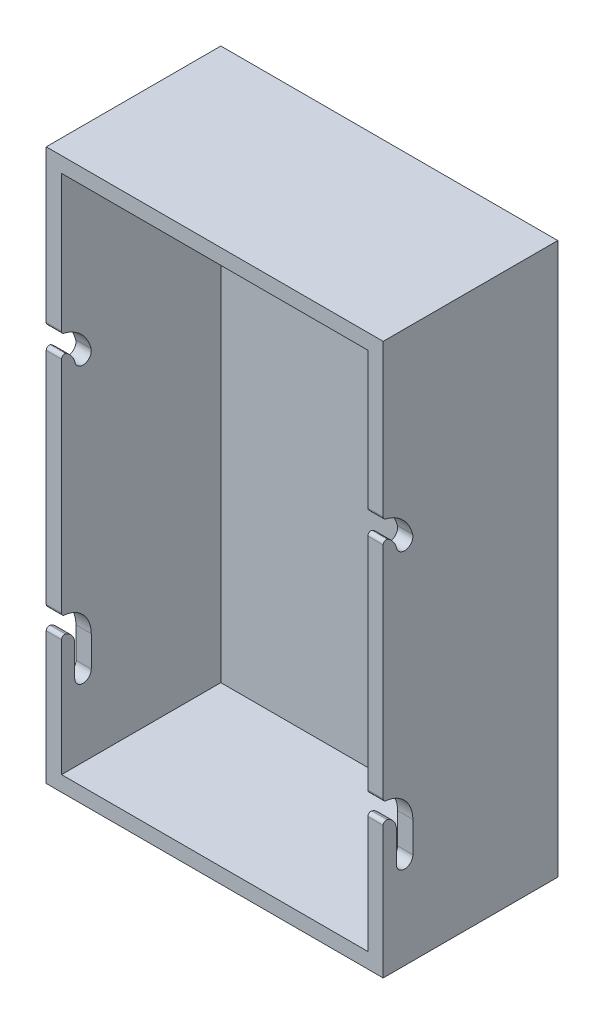
ISO-10303-21;
HEADER;
FILE_DESCRIPTION(('STEP AP214'),'2;1');
FILE_NAME('part.step','',(''),(''),'','','');
FILE_SCHEMA(('AUTOMOTIVE_DESIGN { 1 0 10303 214 1 1 1 1 }'));
ENDSEC;
DATA;
#1=APPLICATION_CONTEXT('core data for automotive mechanical design processes');
#2=APPLICATION_PROTOCOL_DEFINITION('international standard','automotive_design',2000,#1);
#3=PRODUCT_CONTEXT('',#1,'mechanical');
#4=PRODUCT('Part','Part','',(#3));
#5=PRODUCT_RELATED_PRODUCT_CATEGORY('part','',(#4));
#6=PRODUCT_DEFINITION_FORMATION('','',#4);
#7=PRODUCT_DEFINITION_CONTEXT('part definition',#1,'design');
#8=PRODUCT_DEFINITION('design','',#6,#7);
#9=PRODUCT_DEFINITION_SHAPE('','',#8);
#10=(LENGTH_UNIT() NAMED_UNIT(*) SI_UNIT(.MILLI.,.METRE.));
#11=(NAMED_UNIT(*) PLANE_ANGLE_UNIT() SI_UNIT($,.RADIAN.));
#12=(NAMED_UNIT(*) SI_UNIT($,.STERADIAN.) SOLID_ANGLE_UNIT());
#13=UNCERTAINTY_MEASURE_WITH_UNIT(LENGTH_MEASURE(1.E-05),#10,'distance_accuracy_value','');
#14=(GEOMETRIC_REPRESENTATION_CONTEXT(3) GLOBAL_UNCERTAINTY_ASSIGNED_CONTEXT((#13)) GLOBAL_UNIT_ASSIGNED_CONTEXT((#10,
#11,#12)) REPRESENTATION_CONTEXT('',''));
#15=CARTESIAN_POINT('',(0.,0.,0.));
#16=DIRECTION('',(0.,0.,1.));
#17=DIRECTION('',(1.,0.,0.));
#18=AXIS2_PLACEMENT_3D('',#15,#16,#17);
#19=CARTESIAN_POINT('',(0.,0.,57.));
#20=DIRECTION('',(0.,0.,-1.));
#21=DIRECTION('',(-1.,0.,0.));
#22=AXIS2_PLACEMENT_3D('',#19,#20,#21);
#23=PLANE('',#22);
#24=DIRECTION('',(0.,-1.,0.));
#25=VECTOR('',#24,1.);
#26=CARTESIAN_POINT('',(0.,0.,57.));
#27=LINE('',#26,#25);
#28=CARTESIAN_POINT('',(0.,122.457434868641,57.));
#29=VERTEX_POINT('',#28);
#30=CARTESIAN_POINT('',(0.,50.6531685427388,57.));
#31=VERTEX_POINT('',#30);
#32=EDGE_CURVE('E423',#29,#31,#27,.T.);
#33=ORIENTED_EDGE('',*,*,#32,.T.);
#34=DIRECTION('',(-1.,0.,0.));
#35=VECTOR('',#34,1.);
#36=CARTESIAN_POINT('',(0.,50.6531685427388,57.));
#37=LINE('',#36,#35);
#38=CARTESIAN_POINT('',(5.,50.6531685427388,57.));
#39=VERTEX_POINT('',#38);
#40=EDGE_CURVE('E469',#31,#39,#37,.F.);
#41=ORIENTED_EDGE('',*,*,#40,.T.);
#42=DIRECTION('',(0.,-1.,0.));
#43=VECTOR('',#42,1.);
#44=CARTESIAN_POINT('',(5.,5.,57.));
#45=LINE('',#44,#43);
#46=CARTESIAN_POINT('',(5.,122.457434868641,57.));
#47=VERTEX_POINT('',#46);
#48=EDGE_CURVE('E397',#47,#39,#45,.T.);
#49=ORIENTED_EDGE('',*,*,#48,.F.);
#50=DIRECTION('',(1.,0.,0.));
#51=VECTOR('',#50,1.);
#52=CARTESIAN_POINT('',(0.,122.457434868641,57.));
#53=LINE('',#52,#51);
#54=EDGE_CURVE('E467',#47,#29,#53,.F.);
#55=ORIENTED_EDGE('',*,*,#54,.T.);
#56=EDGE_LOOP('',(#33,#41,#49,#55));
#57=FACE_BOUND('',#56,.T.);
#58=ADVANCED_FACE('F34',(#57),#23,.F.);
#59=DIRECTION('',(0.,1.,0.));
#60=VECTOR('',#59,1.);
#61=CARTESIAN_POINT('',(105.,5.,57.));
#62=LINE('',#61,#60);
#63=CARTESIAN_POINT('',(105.,50.6531685427388,57.));
#64=VERTEX_POINT('',#63);
#65=CARTESIAN_POINT('',(105.,122.457434868641,57.));
#66=VERTEX_POINT('',#65);
#67=EDGE_CURVE('E404',#64,#66,#62,.T.);
#68=ORIENTED_EDGE('',*,*,#67,.F.);
#69=DIRECTION('',(-1.,0.,0.));
#70=VECTOR('',#69,1.);
#71=CARTESIAN_POINT('',(0.,50.6531685427388,57.));
#72=LINE('',#71,#70);
#73=CARTESIAN_POINT('',(110.,50.6531685427388,57.));
#74=VERTEX_POINT('',#73);
#75=EDGE_CURVE('E492',#64,#74,#72,.F.);
#76=ORIENTED_EDGE('',*,*,#75,.T.);
#77=DIRECTION('',(0.,1.,0.));
#78=VECTOR('',#77,1.);
#79=CARTESIAN_POINT('',(110.,0.,57.));
#80=LINE('',#79,#78);
#81=CARTESIAN_POINT('',(110.,122.457434868641,57.));
#82=VERTEX_POINT('',#81);
#83=EDGE_CURVE('E430',#74,#82,#80,.T.);
#84=ORIENTED_EDGE('',*,*,#83,.T.);
#85=DIRECTION('',(1.,0.,0.));
#86=VECTOR('',#85,1.);
#87=CARTESIAN_POINT('',(105.,122.457434868641,57.));
#88=LINE('',#87,#86);
#89=EDGE_CURVE('E490',#82,#66,#88,.F.);
#90=ORIENTED_EDGE('',*,*,#89,.T.);
#91=EDGE_LOOP('',(#68,#76,#84,#90));
#92=FACE_BOUND('',#91,.T.);
#93=ADVANCED_FACE('F531',(#92),#23,.F.);
#94=CARTESIAN_POINT('',(110.,0.,57.));
#95=VERTEX_POINT('',#94);
#96=CARTESIAN_POINT('',(110.,43.1448370387033,57.));
#97=VERTEX_POINT('',#96);
#98=EDGE_CURVE('E427',#95,#97,#80,.T.);
#99=ORIENTED_EDGE('',*,*,#98,.T.);
#100=DIRECTION('',(1.,0.,0.));
#101=VECTOR('',#100,1.);
#102=CARTESIAN_POINT('',(105.,43.1448370387033,57.));
#103=LINE('',#102,#101);
#104=CARTESIAN_POINT('',(105.,43.1448370387033,57.));
#105=VERTEX_POINT('',#104);
#106=EDGE_CURVE('E503',#97,#105,#103,.F.);
#107=ORIENTED_EDGE('',*,*,#106,.T.);
#108=CARTESIAN_POINT('',(105.,5.,57.));
#109=VERTEX_POINT('',#108);
#110=EDGE_CURVE('E400',#109,#105,#62,.T.);
#111=ORIENTED_EDGE('',*,*,#110,.F.);
#112=DIRECTION('',(1.,0.,0.));
#113=VECTOR('',#112,1.);
#114=CARTESIAN_POINT('',(5.,5.,57.));
#115=LINE('',#114,#113);
#116=CARTESIAN_POINT('',(5.,5.,57.));
#117=VERTEX_POINT('',#116);
#118=EDGE_CURVE('E396',#117,#109,#115,.T.);
#119=ORIENTED_EDGE('',*,*,#118,.F.);
#120=CARTESIAN_POINT('',(5.,43.1448370387033,57.));
#121=VERTEX_POINT('',#120);
#122=EDGE_CURVE('E392',#121,#117,#45,.T.);
#123=ORIENTED_EDGE('',*,*,#122,.F.);
#124=DIRECTION('',(1.,0.,0.));
#125=VECTOR('',#124,1.);
#126=CARTESIAN_POINT('',(0.,43.1448370387033,57.));
#127=LINE('',#126,#125);
#128=CARTESIAN_POINT('',(0.,43.1448370387033,57.));
#129=VERTEX_POINT('',#128);
#130=EDGE_CURVE('E500',#121,#129,#127,.F.);
#131=ORIENTED_EDGE('',*,*,#130,.T.);
#132=CARTESIAN_POINT('',(0.,0.,57.));
#133=VERTEX_POINT('',#132);
#134=EDGE_CURVE('E424',#129,#133,#27,.T.);
#135=ORIENTED_EDGE('',*,*,#134,.T.);
#136=DIRECTION('',(1.,0.,0.));
#137=VECTOR('',#136,1.);
#138=CARTESIAN_POINT('',(0.,0.,57.));
#139=LINE('',#138,#137);
#140=EDGE_CURVE('E422',#133,#95,#139,.T.);
#141=ORIENTED_EDGE('',*,*,#140,.T.);
#142=EDGE_LOOP('',(#99,#107,#111,#119,#123,#131,#135,#141));
#143=FACE_BOUND('',#142,.T.);
#144=ADVANCED_FACE('F563',(#143),#23,.F.);
#145=CARTESIAN_POINT('',(5.,5.,57.));
#146=DIRECTION('',(1.,0.,0.));
#147=DIRECTION('',(0.,0.,-1.));
#148=AXIS2_PLACEMENT_3D('',#145,#146,#147);
#149=PLANE('',#148);
#150=ORIENTED_EDGE('',*,*,#48,.T.);
#151=CARTESIAN_POINT('',(5.,50.6531685427388,56.));
#152=DIRECTION('',(1.,0.,0.));
#153=DIRECTION('',(0.,0.,-1.));
#154=AXIS2_PLACEMENT_3D('',#151,#152,#153);
#155=CIRCLE('',#154,1.);
#156=CARTESIAN_POINT('',(5.,49.6575453144455,56.0934579439252));
#157=VERTEX_POINT('',#156);
#158=EDGE_CURVE('E477',#39,#157,#155,.T.);
#159=ORIENTED_EDGE('',*,*,#158,.T.);
#160=CARTESIAN_POINT('',(5.,40.,57.));
#161=DIRECTION('',(1.,0.,0.));
#162=DIRECTION('',(0.,0.,-1.));
#163=AXIS2_PLACEMENT_3D('',#160,#161,#162);
#164=CIRCLE('',#163,9.69999999999999);
#165=CARTESIAN_POINT('',(5.,40.,47.3));
#166=VERTEX_POINT('',#165);
#167=EDGE_CURVE('E367',#166,#157,#164,.T.);
#168=ORIENTED_EDGE('',*,*,#167,.F.);
#169=DIRECTION('',(0.,1.,0.));
#170=VECTOR('',#169,1.);
#171=CARTESIAN_POINT('',(5.,5.,47.3));
#172=LINE('',#171,#170);
#173=CARTESIAN_POINT('',(5.,30.,47.3));
#174=VERTEX_POINT('',#173);
#175=EDGE_CURVE('E348',#174,#166,#172,.T.);
#176=ORIENTED_EDGE('',*,*,#175,.F.);
#177=CARTESIAN_POINT('',(5.,30.,50.));
#178=DIRECTION('',(1.,0.,0.));
#179=DIRECTION('',(0.,0.,-1.));
#180=AXIS2_PLACEMENT_3D('',#177,#178,#179);
#181=CIRCLE('',#180,2.7);
#182=CARTESIAN_POINT('',(5.,30.,52.7));
#183=VERTEX_POINT('',#182);
#184=EDGE_CURVE('E352',#183,#174,#181,.T.);
#185=ORIENTED_EDGE('',*,*,#184,.F.);
#186=DIRECTION('',(0.,1.,0.));
#187=VECTOR('',#186,1.);
#188=CARTESIAN_POINT('',(5.,5.,52.7));
#189=LINE('',#188,#187);
#190=CARTESIAN_POINT('',(5.,40.,52.7));
#191=VERTEX_POINT('',#190);
#192=EDGE_CURVE('E357',#183,#191,#189,.T.);
#193=ORIENTED_EDGE('',*,*,#192,.T.);
#194=CARTESIAN_POINT('',(5.,40.,57.));
#195=DIRECTION('',(1.,0.,0.));
#196=DIRECTION('',(0.,0.,-1.));
#197=AXIS2_PLACEMENT_3D('',#194,#195,#196);
#198=CIRCLE('',#197,4.30000000000001);
#199=CARTESIAN_POINT('',(5.,44.0978179595225,55.6969696969697));
#200=VERTEX_POINT('',#199);
#201=EDGE_CURVE('E362',#191,#200,#198,.T.);
#202=ORIENTED_EDGE('',*,*,#201,.T.);
#203=CARTESIAN_POINT('',(5.,43.1448370387033,56.));
#204=DIRECTION('',(1.,0.,0.));
#205=DIRECTION('',(0.,0.,-1.));
#206=AXIS2_PLACEMENT_3D('',#203,#204,#205);
#207=CIRCLE('',#206,1.);
#208=EDGE_CURVE('E475',#200,#121,#207,.T.);
#209=ORIENTED_EDGE('',*,*,#208,.T.);
#210=ORIENTED_EDGE('',*,*,#122,.T.);
#211=DIRECTION('',(0.,0.,-1.));
#212=VECTOR('',#211,1.);
#213=CARTESIAN_POINT('',(5.,5.,57.));
#214=LINE('',#213,#212);
#215=CARTESIAN_POINT('',(5.,5.,5.));
#216=VERTEX_POINT('',#215);
#217=EDGE_CURVE('E415',#117,#216,#214,.T.);
#218=ORIENTED_EDGE('',*,*,#217,.T.);
#219=DIRECTION('',(0.,1.,0.));
#220=VECTOR('',#219,1.);
#221=CARTESIAN_POINT('',(5.,5.,5.));
#222=LINE('',#221,#220);
#223=CARTESIAN_POINT('',(5.,175.,5.));
#224=VERTEX_POINT('',#223);
#225=EDGE_CURVE('E389',#216,#224,#222,.T.);
#226=ORIENTED_EDGE('',*,*,#225,.T.);
#227=DIRECTION('',(0.,0.,-1.));
#228=VECTOR('',#227,1.);
#229=CARTESIAN_POINT('',(5.,175.,57.));
#230=LINE('',#229,#228);
#231=CARTESIAN_POINT('',(5.,175.,57.));
#232=VERTEX_POINT('',#231);
#233=EDGE_CURVE('E406',#232,#224,#230,.T.);
#234=ORIENTED_EDGE('',*,*,#233,.F.);
#235=CARTESIAN_POINT('',(5.,130.367480568589,57.));
#236=VERTEX_POINT('',#235);
#237=EDGE_CURVE('E393',#232,#236,#45,.T.);
#238=ORIENTED_EDGE('',*,*,#237,.T.);
#239=CARTESIAN_POINT('',(5.,130.367480568589,56.));
#240=DIRECTION('',(1.,0.,0.));
#241=DIRECTION('',(0.,0.,-1.));
#242=AXIS2_PLACEMENT_3D('',#239,#240,#241);
#243=CIRCLE('',#242,1.);
#244=CARTESIAN_POINT('',(5.,129.393697628595,56.2274791985588));
#245=VERTEX_POINT('',#244);
#246=EDGE_CURVE('E471',#236,#245,#243,.T.);
#247=ORIENTED_EDGE('',*,*,#246,.T.);
#248=CARTESIAN_POINT('',(5.,117.805680642668,58.9344816614082));
#249=DIRECTION('',(1.,0.,0.));
#250=DIRECTION('',(0.,0.,-1.));
#251=AXIS2_PLACEMENT_3D('',#248,#249,#250);
#252=CIRCLE('',#251,11.9);
#253=CARTESIAN_POINT('',(5.,120.643985028782,47.3779238602389));
#254=VERTEX_POINT('',#253);
#255=EDGE_CURVE('E380',#254,#245,#252,.T.);
#256=ORIENTED_EDGE('',*,*,#255,.F.);
#257=CARTESIAN_POINT('',(5.,120.,50.));
#258=DIRECTION('',(1.,0.,0.));
#259=DIRECTION('',(0.,0.,-1.));
#260=AXIS2_PLACEMENT_3D('',#257,#258,#259);
#261=CIRCLE('',#260,2.7);
#262=CARTESIAN_POINT('',(5.,119.356014971218,52.6220761397611));
#263=VERTEX_POINT('',#262);
#264=EDGE_CURVE('E372',#263,#254,#261,.T.);
#265=ORIENTED_EDGE('',*,*,#264,.F.);
#266=CARTESIAN_POINT('',(5.,117.805680642668,58.9344816614082));
#267=DIRECTION('',(1.,0.,0.));
#268=DIRECTION('',(0.,0.,-1.));
#269=AXIS2_PLACEMENT_3D('',#266,#267,#268);
#270=CIRCLE('',#269,6.5);
#271=CARTESIAN_POINT('',(5.,123.303208364273,55.466457879744));
#272=VERTEX_POINT('',#271);
#273=EDGE_CURVE('E376',#263,#272,#270,.T.);
#274=ORIENTED_EDGE('',*,*,#273,.T.);
#275=CARTESIAN_POINT('',(5.,122.457434868641,56.));
#276=DIRECTION('',(1.,0.,0.));
#277=DIRECTION('',(0.,0.,-1.));
#278=AXIS2_PLACEMENT_3D('',#275,#276,#277);
#279=CIRCLE('',#278,1.);
#280=EDGE_CURVE('E473',#272,#47,#279,.T.);
#281=ORIENTED_EDGE('',*,*,#280,.T.);
#282=EDGE_LOOP('',(#150,#159,#168,#176,#185,#193,#202,#209,#210,#218,#226,#234,#238,#247,#256,
#265,#274,#281));
#283=FACE_BOUND('',#282,.T.);
#284=ADVANCED_FACE('F552',(#283),#149,.T.);
#285=CARTESIAN_POINT('',(5.,5.,57.));
#286=DIRECTION('',(0.,1.,0.));
#287=DIRECTION('',(-1.,0.,0.));
#288=AXIS2_PLACEMENT_3D('',#285,#286,#287);
#289=PLANE('',#288);
#290=DIRECTION('',(0.,0.,-1.));
#291=VECTOR('',#290,1.);
#292=CARTESIAN_POINT('',(105.,5.,57.));
#293=LINE('',#292,#291);
#294=CARTESIAN_POINT('',(105.,5.,5.));
#295=VERTEX_POINT('',#294);
#296=EDGE_CURVE('E412',#109,#295,#293,.T.);
#297=ORIENTED_EDGE('',*,*,#296,.T.);
#298=DIRECTION('',(-1.,0.,0.));
#299=VECTOR('',#298,1.);
#300=CARTESIAN_POINT('',(5.,5.,5.));
#301=LINE('',#300,#299);
#302=EDGE_CURVE('E386',#295,#216,#301,.T.);
#303=ORIENTED_EDGE('',*,*,#302,.T.);
#304=ORIENTED_EDGE('',*,*,#217,.F.);
#305=ORIENTED_EDGE('',*,*,#118,.T.);
#306=EDGE_LOOP('',(#297,#303,#304,#305));
#307=FACE_BOUND('',#306,.T.);
#308=ADVANCED_FACE('F558',(#307),#289,.T.);
#309=CARTESIAN_POINT('',(105.,5.,57.));
#310=DIRECTION('',(-1.,0.,0.));
#311=DIRECTION('',(0.,0.,1.));
#312=AXIS2_PLACEMENT_3D('',#309,#310,#311);
#313=PLANE('',#312);
#314=CARTESIAN_POINT('',(105.,40.,57.));
#315=DIRECTION('',(-1.,0.,0.));
#316=DIRECTION('',(0.,0.,1.));
#317=AXIS2_PLACEMENT_3D('',#314,#315,#316);
#318=CIRCLE('',#317,9.69999999999999);
#319=CARTESIAN_POINT('',(105.,49.6575453144455,56.0934579439252));
#320=VERTEX_POINT('',#319);
#321=CARTESIAN_POINT('',(105.,40.,47.3));
#322=VERTEX_POINT('',#321);
#323=EDGE_CURVE('E365',#320,#322,#318,.T.);
#324=ORIENTED_EDGE('',*,*,#323,.F.);
#325=CARTESIAN_POINT('',(105.,50.6531685427388,56.));
#326=DIRECTION('',(-1.,0.,0.));
#327=DIRECTION('',(0.,0.,1.));
#328=AXIS2_PLACEMENT_3D('',#325,#326,#327);
#329=CIRCLE('',#328,1.);
#330=EDGE_CURVE('E488',#320,#64,#329,.T.);
#331=ORIENTED_EDGE('',*,*,#330,.T.);
#332=ORIENTED_EDGE('',*,*,#67,.T.);
#333=CARTESIAN_POINT('',(105.,122.457434868641,56.));
#334=DIRECTION('',(-1.,0.,0.));
#335=DIRECTION('',(0.,0.,1.));
#336=AXIS2_PLACEMENT_3D('',#333,#334,#335);
#337=CIRCLE('',#336,1.);
#338=CARTESIAN_POINT('',(105.,123.303208364273,55.466457879744));
#339=VERTEX_POINT('',#338);
#340=EDGE_CURVE('E484',#66,#339,#337,.T.);
#341=ORIENTED_EDGE('',*,*,#340,.T.);
#342=CARTESIAN_POINT('',(105.,117.805680642668,58.9344816614082));
#343=DIRECTION('',(-1.,0.,0.));
#344=DIRECTION('',(0.,0.,1.));
#345=AXIS2_PLACEMENT_3D('',#342,#343,#344);
#346=CIRCLE('',#345,6.5);
#347=CARTESIAN_POINT('',(105.,119.356014971218,52.6220761397611));
#348=VERTEX_POINT('',#347);
#349=EDGE_CURVE('E374',#339,#348,#346,.T.);
#350=ORIENTED_EDGE('',*,*,#349,.T.);
#351=CARTESIAN_POINT('',(105.,120.,50.));
#352=DIRECTION('',(-1.,0.,0.));
#353=DIRECTION('',(0.,0.,1.));
#354=AXIS2_PLACEMENT_3D('',#351,#352,#353);
#355=CIRCLE('',#354,2.7);
#356=CARTESIAN_POINT('',(105.,120.643985028782,47.3779238602389));
#357=VERTEX_POINT('',#356);
#358=EDGE_CURVE('E370',#357,#348,#355,.T.);
#359=ORIENTED_EDGE('',*,*,#358,.F.);
#360=CARTESIAN_POINT('',(105.,117.805680642668,58.9344816614082));
#361=DIRECTION('',(-1.,0.,0.));
#362=DIRECTION('',(0.,0.,1.));
#363=AXIS2_PLACEMENT_3D('',#360,#361,#362);
#364=CIRCLE('',#363,11.9);
#365=CARTESIAN_POINT('',(105.,129.393697628595,56.2274791985588));
#366=VERTEX_POINT('',#365);
#367=EDGE_CURVE('E284',#366,#357,#364,.T.);
#368=ORIENTED_EDGE('',*,*,#367,.F.);
#369=CARTESIAN_POINT('',(105.,130.367480568589,56.));
#370=DIRECTION('',(-1.,0.,0.));
#371=DIRECTION('',(0.,0.,1.));
#372=AXIS2_PLACEMENT_3D('',#369,#370,#371);
#373=CIRCLE('',#372,1.);
#374=CARTESIAN_POINT('',(105.,130.367480568589,57.));
#375=VERTEX_POINT('',#374);
#376=EDGE_CURVE('E482',#366,#375,#373,.T.);
#377=ORIENTED_EDGE('',*,*,#376,.T.);
#378=CARTESIAN_POINT('',(105.,175.,57.));
#379=VERTEX_POINT('',#378);
#380=EDGE_CURVE('E399',#375,#379,#62,.T.);
#381=ORIENTED_EDGE('',*,*,#380,.T.);
#382=DIRECTION('',(0.,0.,-1.));
#383=VECTOR('',#382,1.);
#384=CARTESIAN_POINT('',(105.,175.,57.));
#385=LINE('',#384,#383);
#386=CARTESIAN_POINT('',(105.,175.,5.00000000000001));
#387=VERTEX_POINT('',#386);
#388=EDGE_CURVE('E409',#379,#387,#385,.T.);
#389=ORIENTED_EDGE('',*,*,#388,.T.);
#390=DIRECTION('',(0.,-1.,0.));
#391=VECTOR('',#390,1.);
#392=CARTESIAN_POINT('',(105.,5.,5.));
#393=LINE('',#392,#391);
#394=EDGE_CURVE('E383',#387,#295,#393,.T.);
#395=ORIENTED_EDGE('',*,*,#394,.T.);
#396=ORIENTED_EDGE('',*,*,#296,.F.);
#397=ORIENTED_EDGE('',*,*,#110,.T.);
#398=CARTESIAN_POINT('',(105.,43.1448370387033,56.));
#399=DIRECTION('',(-1.,0.,0.));
#400=DIRECTION('',(0.,0.,1.));
#401=AXIS2_PLACEMENT_3D('',#398,#399,#400);
#402=CIRCLE('',#401,1.);
#403=CARTESIAN_POINT('',(105.,44.0978179595225,55.6969696969697));
#404=VERTEX_POINT('',#403);
#405=EDGE_CURVE('E486',#105,#404,#402,.T.);
#406=ORIENTED_EDGE('',*,*,#405,.T.);
#407=CARTESIAN_POINT('',(105.,40.,57.));
#408=DIRECTION('',(-1.,0.,0.));
#409=DIRECTION('',(0.,0.,1.));
#410=AXIS2_PLACEMENT_3D('',#407,#408,#409);
#411=CIRCLE('',#410,4.30000000000001);
#412=CARTESIAN_POINT('',(105.,40.,52.7));
#413=VERTEX_POINT('',#412);
#414=EDGE_CURVE('E360',#404,#413,#411,.T.);
#415=ORIENTED_EDGE('',*,*,#414,.T.);
#416=DIRECTION('',(0.,-1.,0.));
#417=VECTOR('',#416,1.);
#418=CARTESIAN_POINT('',(105.,5.,52.7));
#419=LINE('',#418,#417);
#420=CARTESIAN_POINT('',(105.,30.,52.7));
#421=VERTEX_POINT('',#420);
#422=EDGE_CURVE('E354',#413,#421,#419,.T.);
#423=ORIENTED_EDGE('',*,*,#422,.T.);
#424=CARTESIAN_POINT('',(105.,30.,50.));
#425=DIRECTION('',(-1.,0.,0.));
#426=DIRECTION('',(0.,0.,1.));
#427=AXIS2_PLACEMENT_3D('',#424,#425,#426);
#428=CIRCLE('',#427,2.7);
#429=CARTESIAN_POINT('',(105.,30.,47.3));
#430=VERTEX_POINT('',#429);
#431=EDGE_CURVE('E350',#430,#421,#428,.T.);
#432=ORIENTED_EDGE('',*,*,#431,.F.);
#433=DIRECTION('',(0.,-1.,0.));
#434=VECTOR('',#433,1.);
#435=CARTESIAN_POINT('',(105.,5.,47.3));
#436=LINE('',#435,#434);
#437=EDGE_CURVE('E305',#322,#430,#436,.T.);
#438=ORIENTED_EDGE('',*,*,#437,.F.);
#439=EDGE_LOOP('',(#324,#331,#332,#341,#350,#359,#368,#377,#381,#389,#395,#396,#397,#406,#415,
#423,#432,#438));
#440=FACE_BOUND('',#439,.T.);
#441=ADVANCED_FACE('F537',(#440),#313,.T.);
#442=CARTESIAN_POINT('',(5.,175.,57.));
#443=DIRECTION('',(0.,-1.,0.));
#444=DIRECTION('',(0.,0.,-1.));
#445=AXIS2_PLACEMENT_3D('',#442,#443,#444);
#446=PLANE('',#445);
#447=ORIENTED_EDGE('',*,*,#233,.T.);
#448=DIRECTION('',(1.,0.,0.));
#449=VECTOR('',#448,1.);
#450=CARTESIAN_POINT('',(5.,175.,5.));
#451=LINE('',#450,#449);
#452=EDGE_CURVE('E451',#224,#387,#451,.T.);
#453=ORIENTED_EDGE('',*,*,#452,.T.);
#454=ORIENTED_EDGE('',*,*,#388,.F.);
#455=DIRECTION('',(-1.,0.,0.));
#456=VECTOR('',#455,1.);
#457=CARTESIAN_POINT('',(5.,175.,57.));
#458=LINE('',#457,#456);
#459=EDGE_CURVE('E403',#379,#232,#458,.T.);
#460=ORIENTED_EDGE('',*,*,#459,.T.);
#461=EDGE_LOOP('',(#447,#453,#454,#460));
#462=FACE_BOUND('',#461,.T.);
#463=ADVANCED_FACE('F545',(#462),#446,.T.);
#464=CARTESIAN_POINT('',(0.,180.,57.));
#465=VERTEX_POINT('',#464);
#466=CARTESIAN_POINT('',(0.,130.367480568589,57.));
#467=VERTEX_POINT('',#466);
#468=EDGE_CURVE('E419',#465,#467,#27,.T.);
#469=ORIENTED_EDGE('',*,*,#468,.T.);
#470=DIRECTION('',(-1.,0.,0.));
#471=VECTOR('',#470,1.);
#472=CARTESIAN_POINT('',(0.,130.367480568589,57.));
#473=LINE('',#472,#471);
#474=EDGE_CURVE('E515',#467,#236,#473,.F.);
#475=ORIENTED_EDGE('',*,*,#474,.T.);
#476=ORIENTED_EDGE('',*,*,#237,.F.);
#477=ORIENTED_EDGE('',*,*,#459,.F.);
#478=ORIENTED_EDGE('',*,*,#380,.F.);
#479=DIRECTION('',(-1.,0.,0.));
#480=VECTOR('',#479,1.);
#481=CARTESIAN_POINT('',(0.,130.367480568589,57.));
#482=LINE('',#481,#480);
#483=CARTESIAN_POINT('',(110.,130.367480568589,57.));
#484=VERTEX_POINT('',#483);
#485=EDGE_CURVE('E512',#375,#484,#482,.F.);
#486=ORIENTED_EDGE('',*,*,#485,.T.);
#487=CARTESIAN_POINT('',(110.,180.,57.));
#488=VERTEX_POINT('',#487);
#489=EDGE_CURVE('E426',#484,#488,#80,.T.);
#490=ORIENTED_EDGE('',*,*,#489,.T.);
#491=DIRECTION('',(-1.,0.,0.));
#492=VECTOR('',#491,1.);
#493=CARTESIAN_POINT('',(0.,180.,57.));
#494=LINE('',#493,#492);
#495=EDGE_CURVE('E429',#488,#465,#494,.T.);
#496=ORIENTED_EDGE('',*,*,#495,.T.);
#497=EDGE_LOOP('',(#469,#475,#476,#477,#478,#486,#490,#496));
#498=FACE_BOUND('',#497,.T.);
#499=ADVANCED_FACE('F548',(#498),#23,.F.);
#500=CARTESIAN_POINT('',(0.,0.,0.));
#501=DIRECTION('',(0.,0.,-1.));
#502=DIRECTION('',(-1.,0.,0.));
#503=AXIS2_PLACEMENT_3D('',#500,#501,#502);
#504=PLANE('',#503);
#505=DIRECTION('',(0.,-1.,0.));
#506=VECTOR('',#505,1.);
#507=CARTESIAN_POINT('',(0.,0.,0.));
#508=LINE('',#507,#506);
#509=CARTESIAN_POINT('',(0.,180.,0.));
#510=VERTEX_POINT('',#509);
#511=CARTESIAN_POINT('',(0.,0.,0.));
#512=VERTEX_POINT('',#511);
#513=EDGE_CURVE('E418',#510,#512,#508,.T.);
#514=ORIENTED_EDGE('',*,*,#513,.F.);
#515=DIRECTION('',(-1.,0.,0.));
#516=VECTOR('',#515,1.);
#517=CARTESIAN_POINT('',(0.,180.,0.));
#518=LINE('',#517,#516);
#519=CARTESIAN_POINT('',(110.,180.,0.));
#520=VERTEX_POINT('',#519);
#521=EDGE_CURVE('E441',#520,#510,#518,.T.);
#522=ORIENTED_EDGE('',*,*,#521,.F.);
#523=DIRECTION('',(0.,1.,0.));
#524=VECTOR('',#523,1.);
#525=CARTESIAN_POINT('',(110.,0.,0.));
#526=LINE('',#525,#524);
#527=CARTESIAN_POINT('',(110.,0.,0.));
#528=VERTEX_POINT('',#527);
#529=EDGE_CURVE('E438',#528,#520,#526,.T.);
#530=ORIENTED_EDGE('',*,*,#529,.F.);
#531=DIRECTION('',(1.,0.,0.));
#532=VECTOR('',#531,1.);
#533=CARTESIAN_POINT('',(0.,0.,0.));
#534=LINE('',#533,#532);
#535=EDGE_CURVE('E435',#512,#528,#534,.T.);
#536=ORIENTED_EDGE('',*,*,#535,.F.);
#537=EDGE_LOOP('',(#514,#522,#530,#536));
#538=FACE_BOUND('',#537,.T.);
#539=ADVANCED_FACE('F612',(#538),#504,.T.);
#540=CARTESIAN_POINT('',(0.,0.,57.));
#541=DIRECTION('',(1.,0.,0.));
#542=DIRECTION('',(0.,0.,-1.));
#543=AXIS2_PLACEMENT_3D('',#540,#541,#542);
#544=PLANE('',#543);
#545=CARTESIAN_POINT('',(0.,40.,57.));
#546=DIRECTION('',(-1.,0.,0.));
#547=DIRECTION('',(0.,0.,1.));
#548=AXIS2_PLACEMENT_3D('',#545,#546,#547);
#549=CIRCLE('',#548,9.69999999999999);
#550=CARTESIAN_POINT('',(0.,49.6575453144455,56.0934579439252));
#551=VERTEX_POINT('',#550);
#552=CARTESIAN_POINT('',(0.,40.,47.3));
#553=VERTEX_POINT('',#552);
#554=EDGE_CURVE('E321',#551,#553,#549,.T.);
#555=ORIENTED_EDGE('',*,*,#554,.F.);
#556=CARTESIAN_POINT('',(0.,50.6531685427388,56.));
#557=DIRECTION('',(1.,0.,0.));
#558=DIRECTION('',(0.,0.,-1.));
#559=AXIS2_PLACEMENT_3D('',#556,#557,#558);
#560=CIRCLE('',#559,1.);
#561=EDGE_CURVE('E465',#551,#31,#560,.F.);
#562=ORIENTED_EDGE('',*,*,#561,.T.);
#563=ORIENTED_EDGE('',*,*,#32,.F.);
#564=CARTESIAN_POINT('',(0.,122.457434868641,56.));
#565=DIRECTION('',(1.,0.,0.));
#566=DIRECTION('',(0.,0.,-1.));
#567=AXIS2_PLACEMENT_3D('',#564,#565,#566);
#568=CIRCLE('',#567,1.);
#569=CARTESIAN_POINT('',(0.,123.303208364273,55.466457879744));
#570=VERTEX_POINT('',#569);
#571=EDGE_CURVE('E461',#29,#570,#568,.F.);
#572=ORIENTED_EDGE('',*,*,#571,.T.);
#573=CARTESIAN_POINT('',(0.,117.805680642668,58.9344816614082));
#574=DIRECTION('',(-1.,0.,0.));
#575=DIRECTION('',(0.,0.,1.));
#576=AXIS2_PLACEMENT_3D('',#573,#574,#575);
#577=CIRCLE('',#576,6.5);
#578=CARTESIAN_POINT('',(0.,119.356014971218,52.6220761397611));
#579=VERTEX_POINT('',#578);
#580=EDGE_CURVE('E278',#570,#579,#577,.T.);
#581=ORIENTED_EDGE('',*,*,#580,.T.);
#582=CARTESIAN_POINT('',(0.,120.,50.));
#583=DIRECTION('',(-1.,0.,0.));
#584=DIRECTION('',(0.,0.,1.));
#585=AXIS2_PLACEMENT_3D('',#582,#583,#584);
#586=CIRCLE('',#585,2.7);
#587=CARTESIAN_POINT('',(0.,120.643985028782,47.3779238602389));
#588=VERTEX_POINT('',#587);
#589=EDGE_CURVE('E300',#588,#579,#586,.T.);
#590=ORIENTED_EDGE('',*,*,#589,.F.);
#591=CARTESIAN_POINT('',(0.,117.805680642668,58.9344816614082));
#592=DIRECTION('',(-1.,0.,0.));
#593=DIRECTION('',(0.,0.,1.));
#594=AXIS2_PLACEMENT_3D('',#591,#592,#593);
#595=CIRCLE('',#594,11.9);
#596=CARTESIAN_POINT('',(0.,129.393697628595,56.2274791985588));
#597=VERTEX_POINT('',#596);
#598=EDGE_CURVE('E298',#597,#588,#595,.T.);
#599=ORIENTED_EDGE('',*,*,#598,.F.);
#600=CARTESIAN_POINT('',(0.,130.367480568589,56.));
#601=DIRECTION('',(1.,0.,0.));
#602=DIRECTION('',(0.,0.,-1.));
#603=AXIS2_PLACEMENT_3D('',#600,#601,#602);
#604=CIRCLE('',#603,1.);
#605=EDGE_CURVE('E459',#597,#467,#604,.F.);
#606=ORIENTED_EDGE('',*,*,#605,.T.);
#607=ORIENTED_EDGE('',*,*,#468,.F.);
#608=DIRECTION('',(0.,0.,-1.));
#609=VECTOR('',#608,1.);
#610=CARTESIAN_POINT('',(0.,180.,57.));
#611=LINE('',#610,#609);
#612=EDGE_CURVE('E432',#465,#510,#611,.T.);
#613=ORIENTED_EDGE('',*,*,#612,.T.);
#614=ORIENTED_EDGE('',*,*,#513,.T.);
#615=DIRECTION('',(0.,0.,-1.));
#616=VECTOR('',#615,1.);
#617=CARTESIAN_POINT('',(0.,0.,57.));
#618=LINE('',#617,#616);
#619=EDGE_CURVE('E449',#133,#512,#618,.T.);
#620=ORIENTED_EDGE('',*,*,#619,.F.);
#621=ORIENTED_EDGE('',*,*,#134,.F.);
#622=CARTESIAN_POINT('',(0.,43.1448370387033,56.));
#623=DIRECTION('',(1.,0.,0.));
#624=DIRECTION('',(0.,0.,-1.));
#625=AXIS2_PLACEMENT_3D('',#622,#623,#624);
#626=CIRCLE('',#625,1.);
#627=CARTESIAN_POINT('',(0.,44.0978179595225,55.6969696969697));
#628=VERTEX_POINT('',#627);
#629=EDGE_CURVE('E463',#129,#628,#626,.F.);
#630=ORIENTED_EDGE('',*,*,#629,.T.);
#631=CARTESIAN_POINT('',(0.,40.,57.));
#632=DIRECTION('',(-1.,0.,0.));
#633=DIRECTION('',(0.,0.,1.));
#634=AXIS2_PLACEMENT_3D('',#631,#632,#633);
#635=CIRCLE('',#634,4.30000000000001);
#636=CARTESIAN_POINT('',(0.,40.,52.7));
#637=VERTEX_POINT('',#636);
#638=EDGE_CURVE('E310',#628,#637,#635,.T.);
#639=ORIENTED_EDGE('',*,*,#638,.T.);
#640=DIRECTION('',(0.,-1.,0.));
#641=VECTOR('',#640,1.);
#642=CARTESIAN_POINT('',(0.,0.,52.7));
#643=LINE('',#642,#641);
#644=CARTESIAN_POINT('',(0.,30.,52.7));
#645=VERTEX_POINT('',#644);
#646=EDGE_CURVE('E329',#637,#645,#643,.T.);
#647=ORIENTED_EDGE('',*,*,#646,.T.);
#648=CARTESIAN_POINT('',(0.,30.,50.));
#649=DIRECTION('',(-1.,0.,0.));
#650=DIRECTION('',(0.,0.,1.));
#651=AXIS2_PLACEMENT_3D('',#648,#649,#650);
#652=CIRCLE('',#651,2.7);
#653=CARTESIAN_POINT('',(0.,30.,47.3));
#654=VERTEX_POINT('',#653);
#655=EDGE_CURVE('E326',#654,#645,#652,.T.);
#656=ORIENTED_EDGE('',*,*,#655,.F.);
#657=DIRECTION('',(0.,-1.,0.));
#658=VECTOR('',#657,1.);
#659=CARTESIAN_POINT('',(0.,0.,47.3));
#660=LINE('',#659,#658);
#661=EDGE_CURVE('E323',#553,#654,#660,.T.);
#662=ORIENTED_EDGE('',*,*,#661,.F.);
#663=EDGE_LOOP('',(#555,#562,#563,#572,#581,#590,#599,#606,#607,#613,#614,#620,#621,#630,#639,
#647,#656,#662));
#664=FACE_BOUND('',#663,.T.);
#665=ADVANCED_FACE('F617',(#664),#544,.F.);
#666=CARTESIAN_POINT('',(0.,0.,57.));
#667=DIRECTION('',(0.,1.,0.));
#668=DIRECTION('',(0.,0.,1.));
#669=AXIS2_PLACEMENT_3D('',#666,#667,#668);
#670=PLANE('',#669);
#671=ORIENTED_EDGE('',*,*,#535,.T.);
#672=DIRECTION('',(0.,0.,-1.));
#673=VECTOR('',#672,1.);
#674=CARTESIAN_POINT('',(110.,0.,57.));
#675=LINE('',#674,#673);
#676=EDGE_CURVE('E447',#95,#528,#675,.T.);
#677=ORIENTED_EDGE('',*,*,#676,.F.);
#678=ORIENTED_EDGE('',*,*,#140,.F.);
#679=ORIENTED_EDGE('',*,*,#619,.T.);
#680=EDGE_LOOP('',(#671,#677,#678,#679));
#681=FACE_BOUND('',#680,.T.);
#682=ADVANCED_FACE('F710',(#681),#670,.F.);
#683=CARTESIAN_POINT('',(110.,0.,57.));
#684=DIRECTION('',(-1.,0.,0.));
#685=DIRECTION('',(0.,0.,1.));
#686=AXIS2_PLACEMENT_3D('',#683,#684,#685);
#687=PLANE('',#686);
#688=ORIENTED_EDGE('',*,*,#83,.F.);
#689=CARTESIAN_POINT('',(110.,50.6531685427388,56.));
#690=DIRECTION('',(-1.,0.,0.));
#691=DIRECTION('',(0.,0.,1.));
#692=AXIS2_PLACEMENT_3D('',#689,#690,#691);
#693=CIRCLE('',#692,1.);
#694=CARTESIAN_POINT('',(110.,49.6575453144455,56.0934579439252));
#695=VERTEX_POINT('',#694);
#696=EDGE_CURVE('E498',#74,#695,#693,.F.);
#697=ORIENTED_EDGE('',*,*,#696,.T.);
#698=CARTESIAN_POINT('',(110.,40.,57.));
#699=DIRECTION('',(-1.,0.,0.));
#700=DIRECTION('',(0.,0.,1.));
#701=AXIS2_PLACEMENT_3D('',#698,#699,#700);
#702=CIRCLE('',#701,9.69999999999999);
#703=CARTESIAN_POINT('',(110.,40.,47.3));
#704=VERTEX_POINT('',#703);
#705=EDGE_CURVE('E307',#695,#704,#702,.T.);
#706=ORIENTED_EDGE('',*,*,#705,.T.);
#707=DIRECTION('',(0.,-1.,0.));
#708=VECTOR('',#707,1.);
#709=CARTESIAN_POINT('',(110.,0.,47.3));
#710=LINE('',#709,#708);
#711=CARTESIAN_POINT('',(110.,30.,47.3));
#712=VERTEX_POINT('',#711);
#713=EDGE_CURVE('E309',#704,#712,#710,.T.);
#714=ORIENTED_EDGE('',*,*,#713,.T.);
#715=CARTESIAN_POINT('',(110.,30.,50.));
#716=DIRECTION('',(-1.,0.,0.));
#717=DIRECTION('',(0.,0.,1.));
#718=AXIS2_PLACEMENT_3D('',#715,#716,#717);
#719=CIRCLE('',#718,2.7);
#720=CARTESIAN_POINT('',(110.,30.,52.7));
#721=VERTEX_POINT('',#720);
#722=EDGE_CURVE('E313',#712,#721,#719,.T.);
#723=ORIENTED_EDGE('',*,*,#722,.T.);
#724=DIRECTION('',(0.,-1.,0.));
#725=VECTOR('',#724,1.);
#726=CARTESIAN_POINT('',(110.,0.,52.7));
#727=LINE('',#726,#725);
#728=CARTESIAN_POINT('',(110.,40.,52.7));
#729=VERTEX_POINT('',#728);
#730=EDGE_CURVE('E316',#729,#721,#727,.T.);
#731=ORIENTED_EDGE('',*,*,#730,.F.);
#732=CARTESIAN_POINT('',(110.,40.,57.));
#733=DIRECTION('',(-1.,0.,0.));
#734=DIRECTION('',(0.,0.,1.));
#735=AXIS2_PLACEMENT_3D('',#732,#733,#734);
#736=CIRCLE('',#735,4.30000000000001);
#737=CARTESIAN_POINT('',(110.,44.0978179595225,55.6969696969697));
#738=VERTEX_POINT('',#737);
#739=EDGE_CURVE('E318',#738,#729,#736,.T.);
#740=ORIENTED_EDGE('',*,*,#739,.F.);
#741=CARTESIAN_POINT('',(110.,43.1448370387033,56.));
#742=DIRECTION('',(-1.,0.,0.));
#743=DIRECTION('',(0.,0.,1.));
#744=AXIS2_PLACEMENT_3D('',#741,#742,#743);
#745=CIRCLE('',#744,1.);
#746=EDGE_CURVE('E49',#738,#97,#745,.F.);
#747=ORIENTED_EDGE('',*,*,#746,.T.);
#748=ORIENTED_EDGE('',*,*,#98,.F.);
#749=ORIENTED_EDGE('',*,*,#676,.T.);
#750=ORIENTED_EDGE('',*,*,#529,.T.);
#751=DIRECTION('',(0.,0.,-1.));
#752=VECTOR('',#751,1.);
#753=CARTESIAN_POINT('',(110.,180.,57.));
#754=LINE('',#753,#752);
#755=EDGE_CURVE('E445',#488,#520,#754,.T.);
#756=ORIENTED_EDGE('',*,*,#755,.F.);
#757=ORIENTED_EDGE('',*,*,#489,.F.);
#758=CARTESIAN_POINT('',(110.,130.367480568589,56.));
#759=DIRECTION('',(-1.,0.,0.));
#760=DIRECTION('',(0.,0.,1.));
#761=AXIS2_PLACEMENT_3D('',#758,#759,#760);
#762=CIRCLE('',#761,1.);
#763=CARTESIAN_POINT('',(110.,129.393697628595,56.2274791985588));
#764=VERTEX_POINT('',#763);
#765=EDGE_CURVE('E275',#484,#764,#762,.F.);
#766=ORIENTED_EDGE('',*,*,#765,.T.);
#767=CARTESIAN_POINT('',(110.,117.805680642668,58.9344816614082));
#768=DIRECTION('',(-1.,0.,0.));
#769=DIRECTION('',(0.,0.,1.));
#770=AXIS2_PLACEMENT_3D('',#767,#768,#769);
#771=CIRCLE('',#770,11.9);
#772=CARTESIAN_POINT('',(110.,120.643985028782,47.3779238602389));
#773=VERTEX_POINT('',#772);
#774=EDGE_CURVE('E267',#764,#773,#771,.T.);
#775=ORIENTED_EDGE('',*,*,#774,.T.);
#776=CARTESIAN_POINT('',(110.,120.,50.));
#777=DIRECTION('',(-1.,0.,0.));
#778=DIRECTION('',(0.,0.,1.));
#779=AXIS2_PLACEMENT_3D('',#776,#777,#778);
#780=CIRCLE('',#779,2.7);
#781=CARTESIAN_POINT('',(110.,119.356014971218,52.6220761397611));
#782=VERTEX_POINT('',#781);
#783=EDGE_CURVE('E273',#773,#782,#780,.T.);
#784=ORIENTED_EDGE('',*,*,#783,.T.);
#785=CARTESIAN_POINT('',(110.,117.805680642668,58.9344816614082));
#786=DIRECTION('',(-1.,0.,0.));
#787=DIRECTION('',(0.,0.,1.));
#788=AXIS2_PLACEMENT_3D('',#785,#786,#787);
#789=CIRCLE('',#788,6.5);
#790=CARTESIAN_POINT('',(110.,123.303208364273,55.466457879744));
#791=VERTEX_POINT('',#790);
#792=EDGE_CURVE('E454',#791,#782,#789,.T.);
#793=ORIENTED_EDGE('',*,*,#792,.F.);
#794=CARTESIAN_POINT('',(110.,122.457434868641,56.));
#795=DIRECTION('',(-1.,0.,0.));
#796=DIRECTION('',(0.,0.,1.));
#797=AXIS2_PLACEMENT_3D('',#794,#795,#796);
#798=CIRCLE('',#797,1.);
#799=EDGE_CURVE('E495',#791,#82,#798,.F.);
#800=ORIENTED_EDGE('',*,*,#799,.T.);
#801=EDGE_LOOP('',(#688,#697,#706,#714,#723,#731,#740,#747,#748,#749,#750,#756,#757,#766,#775,
#784,#793,#800));
#802=FACE_BOUND('',#801,.T.);
#803=ADVANCED_FACE('F270',(#802),#687,.F.);
#804=CARTESIAN_POINT('',(0.,180.,57.));
#805=DIRECTION('',(0.,-1.,0.));
#806=DIRECTION('',(0.,0.,-1.));
#807=AXIS2_PLACEMENT_3D('',#804,#805,#806);
#808=PLANE('',#807);
#809=ORIENTED_EDGE('',*,*,#521,.T.);
#810=ORIENTED_EDGE('',*,*,#612,.F.);
#811=ORIENTED_EDGE('',*,*,#495,.F.);
#812=ORIENTED_EDGE('',*,*,#755,.T.);
#813=EDGE_LOOP('',(#809,#810,#811,#812));
#814=FACE_BOUND('',#813,.T.);
#815=ADVANCED_FACE('F633',(#814),#808,.F.);
#816=CARTESIAN_POINT('',(0.,0.,5.));
#817=DIRECTION('',(0.,0.,-1.));
#818=DIRECTION('',(-1.,0.,0.));
#819=AXIS2_PLACEMENT_3D('',#816,#817,#818);
#820=PLANE('',#819);
#821=ORIENTED_EDGE('',*,*,#225,.F.);
#822=ORIENTED_EDGE('',*,*,#302,.F.);
#823=ORIENTED_EDGE('',*,*,#394,.F.);
#824=ORIENTED_EDGE('',*,*,#452,.F.);
#825=EDGE_LOOP('',(#821,#822,#823,#824));
#826=FACE_BOUND('',#825,.T.);
#827=ADVANCED_FACE('F556',(#826),#820,.F.);
#828=CARTESIAN_POINT('',(110.,0.,47.3));
#829=DIRECTION('',(0.,0.,-1.));
#830=DIRECTION('',(-1.,0.,0.));
#831=AXIS2_PLACEMENT_3D('',#828,#829,#830);
#832=PLANE('',#831);
#833=ORIENTED_EDGE('',*,*,#437,.T.);
#834=DIRECTION('',(-1.,0.,0.));
#835=VECTOR('',#834,1.);
#836=CARTESIAN_POINT('',(110.,30.,47.3));
#837=LINE('',#836,#835);
#838=EDGE_CURVE('E340',#712,#430,#837,.T.);
#839=ORIENTED_EDGE('',*,*,#838,.F.);
#840=ORIENTED_EDGE('',*,*,#713,.F.);
#841=DIRECTION('',(-1.,0.,0.));
#842=VECTOR('',#841,1.);
#843=CARTESIAN_POINT('',(110.,40.,47.3));
#844=LINE('',#843,#842);
#845=EDGE_CURVE('E344',#704,#322,#844,.T.);
#846=ORIENTED_EDGE('',*,*,#845,.T.);
#847=EDGE_LOOP('',(#833,#839,#840,#846));
#848=FACE_BOUND('',#847,.T.);
#849=ADVANCED_FACE('F581',(#848),#832,.F.);
#850=CARTESIAN_POINT('',(110.,30.,50.));
#851=DIRECTION('',(-1.,0.,0.));
#852=DIRECTION('',(0.,0.,1.));
#853=AXIS2_PLACEMENT_3D('',#850,#851,#852);
#854=CYLINDRICAL_SURFACE('',#853,2.7);
#855=ORIENTED_EDGE('',*,*,#431,.T.);
#856=DIRECTION('',(-1.,0.,0.));
#857=VECTOR('',#856,1.);
#858=CARTESIAN_POINT('',(110.,30.,52.7));
#859=LINE('',#858,#857);
#860=EDGE_CURVE('E336',#721,#421,#859,.T.);
#861=ORIENTED_EDGE('',*,*,#860,.F.);
#862=ORIENTED_EDGE('',*,*,#722,.F.);
#863=ORIENTED_EDGE('',*,*,#838,.T.);
#864=EDGE_LOOP('',(#855,#861,#862,#863));
#865=FACE_BOUND('',#864,.T.);
#866=ADVANCED_FACE('F578',(#865),#854,.F.);
#867=CARTESIAN_POINT('',(110.,0.,52.7));
#868=DIRECTION('',(0.,0.,-1.));
#869=DIRECTION('',(-1.,0.,0.));
#870=AXIS2_PLACEMENT_3D('',#867,#868,#869);
#871=PLANE('',#870);
#872=DIRECTION('',(-1.,0.,0.));
#873=VECTOR('',#872,1.);
#874=CARTESIAN_POINT('',(110.,40.,52.7));
#875=LINE('',#874,#873);
#876=EDGE_CURVE('E301',#729,#413,#875,.T.);
#877=ORIENTED_EDGE('',*,*,#876,.F.);
#878=ORIENTED_EDGE('',*,*,#730,.T.);
#879=ORIENTED_EDGE('',*,*,#860,.T.);
#880=ORIENTED_EDGE('',*,*,#422,.F.);
#881=EDGE_LOOP('',(#877,#878,#879,#880));
#882=FACE_BOUND('',#881,.T.);
#883=ADVANCED_FACE('F573',(#882),#871,.T.);
#884=CARTESIAN_POINT('',(110.,40.,57.));
#885=DIRECTION('',(-1.,0.,0.));
#886=DIRECTION('',(0.,0.,1.));
#887=AXIS2_PLACEMENT_3D('',#884,#885,#886);
#888=CYLINDRICAL_SURFACE('',#887,4.30000000000001);
#889=ORIENTED_EDGE('',*,*,#414,.F.);
#890=DIRECTION('',(-1.,0.,0.));
#891=VECTOR('',#890,1.);
#892=CARTESIAN_POINT('',(110.,44.0978179595225,55.6969696969697));
#893=LINE('',#892,#891);
#894=EDGE_CURVE('E57',#404,#738,#893,.F.);
#895=ORIENTED_EDGE('',*,*,#894,.T.);
#896=ORIENTED_EDGE('',*,*,#739,.T.);
#897=ORIENTED_EDGE('',*,*,#876,.T.);
#898=EDGE_LOOP('',(#889,#895,#896,#897));
#899=FACE_BOUND('',#898,.T.);
#900=ADVANCED_FACE('F569',(#899),#888,.T.);
#901=CARTESIAN_POINT('',(110.,40.,57.));
#902=DIRECTION('',(-1.,0.,0.));
#903=DIRECTION('',(0.,0.,1.));
#904=AXIS2_PLACEMENT_3D('',#901,#902,#903);
#905=CYLINDRICAL_SURFACE('',#904,9.69999999999999);
#906=ORIENTED_EDGE('',*,*,#705,.F.);
#907=DIRECTION('',(-1.,0.,0.));
#908=VECTOR('',#907,1.);
#909=CARTESIAN_POINT('',(110.,49.6575453144455,56.0934579439252));
#910=LINE('',#909,#908);
#911=EDGE_CURVE('E479',#695,#320,#910,.T.);
#912=ORIENTED_EDGE('',*,*,#911,.T.);
#913=ORIENTED_EDGE('',*,*,#323,.T.);
#914=ORIENTED_EDGE('',*,*,#845,.F.);
#915=EDGE_LOOP('',(#906,#912,#913,#914));
#916=FACE_BOUND('',#915,.T.);
#917=ADVANCED_FACE('F586',(#916),#905,.F.);
#918=CARTESIAN_POINT('',(110.,120.,50.));
#919=DIRECTION('',(-1.,0.,0.));
#920=DIRECTION('',(0.,0.,1.));
#921=AXIS2_PLACEMENT_3D('',#918,#919,#920);
#922=CYLINDRICAL_SURFACE('',#921,2.7);
#923=ORIENTED_EDGE('',*,*,#358,.T.);
#924=DIRECTION('',(-1.,0.,0.));
#925=VECTOR('',#924,1.);
#926=CARTESIAN_POINT('',(110.,119.356014971218,52.6220761397611));
#927=LINE('',#926,#925);
#928=EDGE_CURVE('E294',#782,#348,#927,.T.);
#929=ORIENTED_EDGE('',*,*,#928,.F.);
#930=ORIENTED_EDGE('',*,*,#783,.F.);
#931=DIRECTION('',(-1.,0.,0.));
#932=VECTOR('',#931,1.);
#933=CARTESIAN_POINT('',(110.,120.643985028782,47.3779238602389));
#934=LINE('',#933,#932);
#935=EDGE_CURVE('E281',#773,#357,#934,.T.);
#936=ORIENTED_EDGE('',*,*,#935,.T.);
#937=EDGE_LOOP('',(#923,#929,#930,#936));
#938=FACE_BOUND('',#937,.T.);
#939=ADVANCED_FACE('F292',(#938),#922,.F.);
#940=CARTESIAN_POINT('',(110.,117.805680642668,58.9344816614082));
#941=DIRECTION('',(-1.,0.,0.));
#942=DIRECTION('',(0.,0.,1.));
#943=AXIS2_PLACEMENT_3D('',#940,#941,#942);
#944=CYLINDRICAL_SURFACE('',#943,6.5);
#945=ORIENTED_EDGE('',*,*,#349,.F.);
#946=DIRECTION('',(-1.,0.,0.));
#947=VECTOR('',#946,1.);
#948=CARTESIAN_POINT('',(110.,123.303208364273,55.466457879744));
#949=LINE('',#948,#947);
#950=EDGE_CURVE('E42',#339,#791,#949,.F.);
#951=ORIENTED_EDGE('',*,*,#950,.T.);
#952=ORIENTED_EDGE('',*,*,#792,.T.);
#953=ORIENTED_EDGE('',*,*,#928,.T.);
#954=EDGE_LOOP('',(#945,#951,#952,#953));
#955=FACE_BOUND('',#954,.T.);
#956=ADVANCED_FACE('F523',(#955),#944,.T.);
#957=CARTESIAN_POINT('',(110.,117.805680642668,58.9344816614082));
#958=DIRECTION('',(-1.,0.,0.));
#959=DIRECTION('',(0.,0.,1.));
#960=AXIS2_PLACEMENT_3D('',#957,#958,#959);
#961=CYLINDRICAL_SURFACE('',#960,11.9);
#962=ORIENTED_EDGE('',*,*,#774,.F.);
#963=DIRECTION('',(-1.,0.,0.));
#964=VECTOR('',#963,1.);
#965=CARTESIAN_POINT('',(110.,129.393697628595,56.2274791985588));
#966=LINE('',#965,#964);
#967=EDGE_CURVE('E11',#764,#366,#966,.T.);
#968=ORIENTED_EDGE('',*,*,#967,.T.);
#969=ORIENTED_EDGE('',*,*,#367,.T.);
#970=ORIENTED_EDGE('',*,*,#935,.F.);
#971=EDGE_LOOP('',(#962,#968,#969,#970));
#972=FACE_BOUND('',#971,.T.);
#973=ADVANCED_FACE('F282',(#972),#961,.F.);
#974=ORIENTED_EDGE('',*,*,#167,.T.);
#975=DIRECTION('',(-1.,0.,0.));
#976=VECTOR('',#975,1.);
#977=CARTESIAN_POINT('',(110.,49.6575453144455,56.0934579439252));
#978=LINE('',#977,#976);
#979=EDGE_CURVE('E456',#157,#551,#978,.T.);
#980=ORIENTED_EDGE('',*,*,#979,.T.);
#981=ORIENTED_EDGE('',*,*,#554,.T.);
#982=EDGE_CURVE('E320',#166,#553,#844,.T.);
#983=ORIENTED_EDGE('',*,*,#982,.F.);
#984=EDGE_LOOP('',(#974,#980,#981,#983));
#985=FACE_BOUND('',#984,.T.);
#986=ADVANCED_FACE('F636',(#985),#905,.F.);
#987=ORIENTED_EDGE('',*,*,#638,.F.);
#988=DIRECTION('',(-1.,0.,0.));
#989=VECTOR('',#988,1.);
#990=CARTESIAN_POINT('',(110.,44.0978179595225,55.6969696969697));
#991=LINE('',#990,#989);
#992=EDGE_CURVE('E507',#628,#200,#991,.F.);
#993=ORIENTED_EDGE('',*,*,#992,.T.);
#994=ORIENTED_EDGE('',*,*,#201,.F.);
#995=EDGE_CURVE('E335',#191,#637,#875,.T.);
#996=ORIENTED_EDGE('',*,*,#995,.T.);
#997=EDGE_LOOP('',(#987,#993,#994,#996));
#998=FACE_BOUND('',#997,.T.);
#999=ADVANCED_FACE('F648',(#998),#888,.T.);
#1000=EDGE_CURVE('E339',#183,#645,#859,.T.);
#1001=ORIENTED_EDGE('',*,*,#1000,.T.);
#1002=ORIENTED_EDGE('',*,*,#646,.F.);
#1003=ORIENTED_EDGE('',*,*,#995,.F.);
#1004=ORIENTED_EDGE('',*,*,#192,.F.);
#1005=EDGE_LOOP('',(#1001,#1002,#1003,#1004));
#1006=FACE_BOUND('',#1005,.T.);
#1007=ADVANCED_FACE('F645',(#1006),#871,.T.);
#1008=ORIENTED_EDGE('',*,*,#184,.T.);
#1009=EDGE_CURVE('E343',#174,#654,#837,.T.);
#1010=ORIENTED_EDGE('',*,*,#1009,.T.);
#1011=ORIENTED_EDGE('',*,*,#655,.T.);
#1012=ORIENTED_EDGE('',*,*,#1000,.F.);
#1013=EDGE_LOOP('',(#1008,#1010,#1011,#1012));
#1014=FACE_BOUND('',#1013,.T.);
#1015=ADVANCED_FACE('F642',(#1014),#854,.F.);
#1016=ORIENTED_EDGE('',*,*,#175,.T.);
#1017=ORIENTED_EDGE('',*,*,#982,.T.);
#1018=ORIENTED_EDGE('',*,*,#661,.T.);
#1019=ORIENTED_EDGE('',*,*,#1009,.F.);
#1020=EDGE_LOOP('',(#1016,#1017,#1018,#1019));
#1021=FACE_BOUND('',#1020,.T.);
#1022=ADVANCED_FACE('F639',(#1021),#832,.F.);
#1023=ORIENTED_EDGE('',*,*,#255,.T.);
#1024=DIRECTION('',(-1.,0.,0.));
#1025=VECTOR('',#1024,1.);
#1026=CARTESIAN_POINT('',(110.,129.393697628595,56.2274791985588));
#1027=LINE('',#1026,#1025);
#1028=EDGE_CURVE('E518',#245,#597,#1027,.T.);
#1029=ORIENTED_EDGE('',*,*,#1028,.T.);
#1030=ORIENTED_EDGE('',*,*,#598,.T.);
#1031=EDGE_CURVE('E289',#254,#588,#934,.T.);
#1032=ORIENTED_EDGE('',*,*,#1031,.F.);
#1033=EDGE_LOOP('',(#1023,#1029,#1030,#1032));
#1034=FACE_BOUND('',#1033,.T.);
#1035=ADVANCED_FACE('F651',(#1034),#961,.F.);
#1036=ORIENTED_EDGE('',*,*,#580,.F.);
#1037=DIRECTION('',(-1.,0.,0.));
#1038=VECTOR('',#1037,1.);
#1039=CARTESIAN_POINT('',(110.,123.303208364273,55.466457879744));
#1040=LINE('',#1039,#1038);
#1041=EDGE_CURVE('E509',#570,#272,#1040,.F.);
#1042=ORIENTED_EDGE('',*,*,#1041,.T.);
#1043=ORIENTED_EDGE('',*,*,#273,.F.);
#1044=EDGE_CURVE('E288',#263,#579,#927,.T.);
#1045=ORIENTED_EDGE('',*,*,#1044,.T.);
#1046=EDGE_LOOP('',(#1036,#1042,#1043,#1045));
#1047=FACE_BOUND('',#1046,.T.);
#1048=ADVANCED_FACE('F655',(#1047),#944,.T.);
#1049=ORIENTED_EDGE('',*,*,#264,.T.);
#1050=ORIENTED_EDGE('',*,*,#1031,.T.);
#1051=ORIENTED_EDGE('',*,*,#589,.T.);
#1052=ORIENTED_EDGE('',*,*,#1044,.F.);
#1053=EDGE_LOOP('',(#1049,#1050,#1051,#1052));
#1054=FACE_BOUND('',#1053,.T.);
#1055=ADVANCED_FACE('F599',(#1054),#922,.F.);
#1056=CARTESIAN_POINT('',(110.,50.6531685427388,56.));
#1057=DIRECTION('',(-1.,0.,0.));
#1058=DIRECTION('',(0.,0.,1.));
#1059=AXIS2_PLACEMENT_3D('',#1056,#1057,#1058);
#1060=CYLINDRICAL_SURFACE('',#1059,1.);
#1061=ORIENTED_EDGE('',*,*,#158,.F.);
#1062=ORIENTED_EDGE('',*,*,#40,.F.);
#1063=ORIENTED_EDGE('',*,*,#561,.F.);
#1064=ORIENTED_EDGE('',*,*,#979,.F.);
#1065=EDGE_LOOP('',(#1061,#1062,#1063,#1064));
#1066=FACE_BOUND('',#1065,.T.);
#1067=ADVANCED_FACE('F591',(#1066),#1060,.T.);
#1068=CARTESIAN_POINT('',(110.,50.6531685427388,56.));
#1069=DIRECTION('',(-1.,0.,0.));
#1070=DIRECTION('',(0.,0.,1.));
#1071=AXIS2_PLACEMENT_3D('',#1068,#1069,#1070);
#1072=CYLINDRICAL_SURFACE('',#1071,1.);
#1073=ORIENTED_EDGE('',*,*,#696,.F.);
#1074=ORIENTED_EDGE('',*,*,#75,.F.);
#1075=ORIENTED_EDGE('',*,*,#330,.F.);
#1076=ORIENTED_EDGE('',*,*,#911,.F.);
#1077=EDGE_LOOP('',(#1073,#1074,#1075,#1076));
#1078=FACE_BOUND('',#1077,.T.);
#1079=ADVANCED_FACE('F589',(#1078),#1072,.T.);
#1080=CARTESIAN_POINT('',(110.,43.1448370387033,56.));
#1081=DIRECTION('',(-1.,0.,0.));
#1082=DIRECTION('',(0.,0.,1.));
#1083=AXIS2_PLACEMENT_3D('',#1080,#1081,#1082);
#1084=CYLINDRICAL_SURFACE('',#1083,1.);
#1085=ORIENTED_EDGE('',*,*,#746,.F.);
#1086=ORIENTED_EDGE('',*,*,#894,.F.);
#1087=ORIENTED_EDGE('',*,*,#405,.F.);
#1088=ORIENTED_EDGE('',*,*,#106,.F.);
#1089=EDGE_LOOP('',(#1085,#1086,#1087,#1088));
#1090=FACE_BOUND('',#1089,.T.);
#1091=ADVANCED_FACE('F567',(#1090),#1084,.T.);
#1092=CARTESIAN_POINT('',(110.,43.1448370387033,56.));
#1093=DIRECTION('',(-1.,0.,0.));
#1094=DIRECTION('',(0.,0.,1.));
#1095=AXIS2_PLACEMENT_3D('',#1092,#1093,#1094);
#1096=CYLINDRICAL_SURFACE('',#1095,1.);
#1097=ORIENTED_EDGE('',*,*,#208,.F.);
#1098=ORIENTED_EDGE('',*,*,#992,.F.);
#1099=ORIENTED_EDGE('',*,*,#629,.F.);
#1100=ORIENTED_EDGE('',*,*,#130,.F.);
#1101=EDGE_LOOP('',(#1097,#1098,#1099,#1100));
#1102=FACE_BOUND('',#1101,.T.);
#1103=ADVANCED_FACE('F597',(#1102),#1096,.T.);
#1104=CARTESIAN_POINT('',(110.,122.457434868641,56.));
#1105=DIRECTION('',(-1.,0.,0.));
#1106=DIRECTION('',(0.,0.,1.));
#1107=AXIS2_PLACEMENT_3D('',#1104,#1105,#1106);
#1108=CYLINDRICAL_SURFACE('',#1107,1.);
#1109=ORIENTED_EDGE('',*,*,#571,.F.);
#1110=ORIENTED_EDGE('',*,*,#54,.F.);
#1111=ORIENTED_EDGE('',*,*,#280,.F.);
#1112=ORIENTED_EDGE('',*,*,#1041,.F.);
#1113=EDGE_LOOP('',(#1109,#1110,#1111,#1112));
#1114=FACE_BOUND('',#1113,.T.);
#1115=ADVANCED_FACE('F674',(#1114),#1108,.T.);
#1116=CARTESIAN_POINT('',(110.,130.367480568589,56.));
#1117=DIRECTION('',(-1.,0.,0.));
#1118=DIRECTION('',(0.,0.,1.));
#1119=AXIS2_PLACEMENT_3D('',#1116,#1117,#1118);
#1120=CYLINDRICAL_SURFACE('',#1119,1.);
#1121=ORIENTED_EDGE('',*,*,#605,.F.);
#1122=ORIENTED_EDGE('',*,*,#1028,.F.);
#1123=ORIENTED_EDGE('',*,*,#246,.F.);
#1124=ORIENTED_EDGE('',*,*,#474,.F.);
#1125=EDGE_LOOP('',(#1121,#1122,#1123,#1124));
#1126=FACE_BOUND('',#1125,.T.);
#1127=ADVANCED_FACE('F725',(#1126),#1120,.T.);
#1128=CARTESIAN_POINT('',(110.,122.457434868641,56.));
#1129=DIRECTION('',(-1.,0.,0.));
#1130=DIRECTION('',(0.,0.,1.));
#1131=AXIS2_PLACEMENT_3D('',#1128,#1129,#1130);
#1132=CYLINDRICAL_SURFACE('',#1131,1.);
#1133=ORIENTED_EDGE('',*,*,#340,.F.);
#1134=ORIENTED_EDGE('',*,*,#89,.F.);
#1135=ORIENTED_EDGE('',*,*,#799,.F.);
#1136=ORIENTED_EDGE('',*,*,#950,.F.);
#1137=EDGE_LOOP('',(#1133,#1134,#1135,#1136));
#1138=FACE_BOUND('',#1137,.T.);
#1139=ADVANCED_FACE('F534',(#1138),#1132,.T.);
#1140=CARTESIAN_POINT('',(110.,130.367480568589,56.));
#1141=DIRECTION('',(-1.,0.,0.));
#1142=DIRECTION('',(0.,0.,1.));
#1143=AXIS2_PLACEMENT_3D('',#1140,#1141,#1142);
#1144=CYLINDRICAL_SURFACE('',#1143,1.);
#1145=ORIENTED_EDGE('',*,*,#376,.F.);
#1146=ORIENTED_EDGE('',*,*,#967,.F.);
#1147=ORIENTED_EDGE('',*,*,#765,.F.);
#1148=ORIENTED_EDGE('',*,*,#485,.F.);
#1149=EDGE_LOOP('',(#1145,#1146,#1147,#1148));
#1150=FACE_BOUND('',#1149,.T.);
#1151=ADVANCED_FACE('F36',(#1150),#1144,.T.);
#1152=CLOSED_SHELL('',(#58,#93,#144,#284,#308,#441,#463,#499,#539,#665,#682,#803,#815,#827,#849,
#866,#883,#900,#917,#939,#956,#973,#986,#999,#1007,#1015,#1022,#1035,#1048,#1055,#1067,#1079,
#1091,#1103,#1115,#1127,#1139,#1151));
#1153=MANIFOLD_SOLID_BREP('B2',#1152);
#1154=ADVANCED_BREP_SHAPE_REPRESENTATION('',(#18,#1153),#14);
#1155=SHAPE_DEFINITION_REPRESENTATION(#9,#1154);
ENDSEC;
END-ISO-10303-21;
